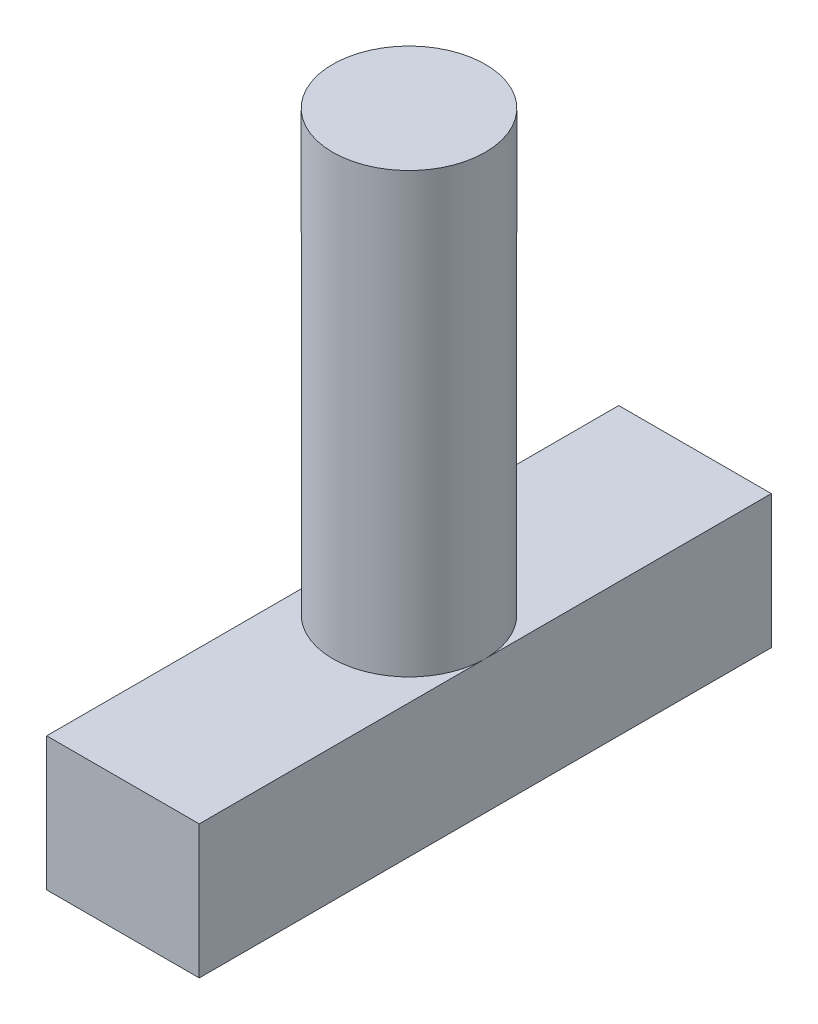
ISO-10303-21;
HEADER;
FILE_DESCRIPTION(('STEP AP214'),'2;1');
FILE_NAME('part.step','',(''),(''),'','','');
FILE_SCHEMA(('AUTOMOTIVE_DESIGN { 1 0 10303 214 1 1 1 1 }'));
ENDSEC;
DATA;
#1=APPLICATION_CONTEXT('core data for automotive mechanical design processes');
#2=APPLICATION_PROTOCOL_DEFINITION('international standard','automotive_design',2000,#1);
#3=PRODUCT_CONTEXT('',#1,'mechanical');
#4=PRODUCT('Part','Part','',(#3));
#5=PRODUCT_RELATED_PRODUCT_CATEGORY('part','',(#4));
#6=PRODUCT_DEFINITION_FORMATION('','',#4);
#7=PRODUCT_DEFINITION_CONTEXT('part definition',#1,'design');
#8=PRODUCT_DEFINITION('design','',#6,#7);
#9=PRODUCT_DEFINITION_SHAPE('','',#8);
#10=(LENGTH_UNIT() NAMED_UNIT(*) SI_UNIT(.MILLI.,.METRE.));
#11=(NAMED_UNIT(*) PLANE_ANGLE_UNIT() SI_UNIT($,.RADIAN.));
#12=(NAMED_UNIT(*) SI_UNIT($,.STERADIAN.) SOLID_ANGLE_UNIT());
#13=UNCERTAINTY_MEASURE_WITH_UNIT(LENGTH_MEASURE(1.E-05),#10,'distance_accuracy_value','');
#14=(GEOMETRIC_REPRESENTATION_CONTEXT(3) GLOBAL_UNCERTAINTY_ASSIGNED_CONTEXT((#13)) GLOBAL_UNIT_ASSIGNED_CONTEXT((#10,
#11,#12)) REPRESENTATION_CONTEXT('',''));
#15=CARTESIAN_POINT('',(0.,0.,0.));
#16=DIRECTION('',(0.,0.,1.));
#17=DIRECTION('',(1.,0.,0.));
#18=AXIS2_PLACEMENT_3D('',#15,#16,#17);
#19=CARTESIAN_POINT('',(0.,15.,0.));
#20=DIRECTION('',(0.,-1.,0.));
#21=DIRECTION('',(0.,0.,-1.));
#22=AXIS2_PLACEMENT_3D('',#19,#20,#21);
#23=CYLINDRICAL_SURFACE('',#22,2.);
#24=CARTESIAN_POINT('',(0.,15.,0.));
#25=DIRECTION('',(0.,1.,0.));
#26=DIRECTION('',(0.,0.,1.));
#27=AXIS2_PLACEMENT_3D('',#24,#25,#26);
#28=CIRCLE('',#27,2.);
#29=CARTESIAN_POINT('',(0.,15.,2.));
#30=VERTEX_POINT('',#29);
#31=EDGE_CURVE('E99',#30,#30,#28,.T.);
#32=ORIENTED_EDGE('',*,*,#31,.F.);
#33=EDGE_LOOP('',(#32));
#34=FACE_BOUND('',#33,.T.);
#35=CARTESIAN_POINT('',(0.,3.5,0.));
#36=DIRECTION('',(0.,-1.,0.));
#37=DIRECTION('',(0.,0.,-1.));
#38=AXIS2_PLACEMENT_3D('',#35,#36,#37);
#39=CIRCLE('',#38,2.);
#40=CARTESIAN_POINT('',(2.,3.5,0.));
#41=VERTEX_POINT('',#40);
#42=CARTESIAN_POINT('',(-2.,3.5,0.));
#43=VERTEX_POINT('',#42);
#44=EDGE_CURVE('E11',#41,#43,#39,.T.);
#45=ORIENTED_EDGE('',*,*,#44,.F.);
#46=EDGE_CURVE('E36',#43,#41,#39,.T.);
#47=ORIENTED_EDGE('',*,*,#46,.F.);
#48=EDGE_LOOP('',(#45,#47));
#49=FACE_BOUND('',#48,.T.);
#50=ADVANCED_FACE('F33',(#34,#49),#23,.T.);
#51=CARTESIAN_POINT('',(0.,15.,0.));
#52=DIRECTION('',(0.,1.,0.));
#53=DIRECTION('',(0.,0.,1.));
#54=AXIS2_PLACEMENT_3D('',#51,#52,#53);
#55=PLANE('',#54);
#56=ORIENTED_EDGE('',*,*,#31,.T.);
#57=EDGE_LOOP('',(#56));
#58=FACE_BOUND('',#57,.T.);
#59=ADVANCED_FACE('F142',(#58),#55,.T.);
#60=CARTESIAN_POINT('',(0.,3.5,0.));
#61=DIRECTION('',(0.,-1.,0.));
#62=DIRECTION('',(0.,0.,-1.));
#63=AXIS2_PLACEMENT_3D('',#60,#61,#62);
#64=PLANE('',#63);
#65=DIRECTION('',(0.,0.,-1.));
#66=VECTOR('',#65,1.);
#67=CARTESIAN_POINT('',(2.,3.5,-7.5));
#68=LINE('',#67,#66);
#69=CARTESIAN_POINT('',(2.,3.5,7.5));
#70=VERTEX_POINT('',#69);
#71=EDGE_CURVE('E118',#70,#41,#68,.T.);
#72=ORIENTED_EDGE('',*,*,#71,.T.);
#73=ORIENTED_EDGE('',*,*,#44,.T.);
#74=DIRECTION('',(0.,0.,1.));
#75=VECTOR('',#74,1.);
#76=CARTESIAN_POINT('',(-2.,3.5,-7.5));
#77=LINE('',#76,#75);
#78=CARTESIAN_POINT('',(-2.,3.5,7.5));
#79=VERTEX_POINT('',#78);
#80=EDGE_CURVE('E72',#43,#79,#77,.T.);
#81=ORIENTED_EDGE('',*,*,#80,.T.);
#82=DIRECTION('',(1.,0.,0.));
#83=VECTOR('',#82,1.);
#84=CARTESIAN_POINT('',(2.,3.5,7.5));
#85=LINE('',#84,#83);
#86=EDGE_CURVE('E76',#79,#70,#85,.T.);
#87=ORIENTED_EDGE('',*,*,#86,.T.);
#88=EDGE_LOOP('',(#72,#73,#81,#87));
#89=FACE_BOUND('',#88,.T.);
#90=ADVANCED_FACE('F75',(#89),#64,.F.);
#91=CARTESIAN_POINT('',(-2.,3.5,-7.5));
#92=VERTEX_POINT('',#91);
#93=EDGE_CURVE('E82',#92,#43,#77,.T.);
#94=ORIENTED_EDGE('',*,*,#93,.T.);
#95=ORIENTED_EDGE('',*,*,#46,.T.);
#96=CARTESIAN_POINT('',(2.,3.5,-7.5));
#97=VERTEX_POINT('',#96);
#98=EDGE_CURVE('E93',#41,#97,#68,.T.);
#99=ORIENTED_EDGE('',*,*,#98,.T.);
#100=DIRECTION('',(-1.,0.,0.));
#101=VECTOR('',#100,1.);
#102=CARTESIAN_POINT('',(2.,3.5,-7.5));
#103=LINE('',#102,#101);
#104=EDGE_CURVE('E109',#97,#92,#103,.T.);
#105=ORIENTED_EDGE('',*,*,#104,.T.);
#106=EDGE_LOOP('',(#94,#95,#99,#105));
#107=FACE_BOUND('',#106,.T.);
#108=ADVANCED_FACE('F120',(#107),#64,.F.);
#109=CARTESIAN_POINT('',(-2.,3.5,-7.5));
#110=DIRECTION('',(1.,0.,0.));
#111=DIRECTION('',(0.,0.,-1.));
#112=AXIS2_PLACEMENT_3D('',#109,#110,#111);
#113=PLANE('',#112);
#114=ORIENTED_EDGE('',*,*,#80,.F.);
#115=ORIENTED_EDGE('',*,*,#93,.F.);
#116=DIRECTION('',(0.,-1.,0.));
#117=VECTOR('',#116,1.);
#118=CARTESIAN_POINT('',(-2.,3.5,-7.5));
#119=LINE('',#118,#117);
#120=CARTESIAN_POINT('',(-2.,0.,-7.5));
#121=VERTEX_POINT('',#120);
#122=EDGE_CURVE('E107',#92,#121,#119,.T.);
#123=ORIENTED_EDGE('',*,*,#122,.T.);
#124=DIRECTION('',(0.,0.,1.));
#125=VECTOR('',#124,1.);
#126=CARTESIAN_POINT('',(-2.,0.,-7.5));
#127=LINE('',#126,#125);
#128=CARTESIAN_POINT('',(-2.,0.,7.5));
#129=VERTEX_POINT('',#128);
#130=EDGE_CURVE('E97',#121,#129,#127,.T.);
#131=ORIENTED_EDGE('',*,*,#130,.T.);
#132=DIRECTION('',(0.,-1.,0.));
#133=VECTOR('',#132,1.);
#134=CARTESIAN_POINT('',(-2.,3.5,7.5));
#135=LINE('',#134,#133);
#136=EDGE_CURVE('E89',#79,#129,#135,.T.);
#137=ORIENTED_EDGE('',*,*,#136,.F.);
#138=EDGE_LOOP('',(#114,#115,#123,#131,#137));
#139=FACE_BOUND('',#138,.T.);
#140=ADVANCED_FACE('F95',(#139),#113,.F.);
#141=CARTESIAN_POINT('',(2.,3.5,-7.5));
#142=DIRECTION('',(-1.,0.,0.));
#143=DIRECTION('',(0.,0.,1.));
#144=AXIS2_PLACEMENT_3D('',#141,#142,#143);
#145=PLANE('',#144);
#146=ORIENTED_EDGE('',*,*,#98,.F.);
#147=ORIENTED_EDGE('',*,*,#71,.F.);
#148=DIRECTION('',(0.,-1.,0.));
#149=VECTOR('',#148,1.);
#150=CARTESIAN_POINT('',(2.,3.5,7.5));
#151=LINE('',#150,#149);
#152=CARTESIAN_POINT('',(2.,0.,7.5));
#153=VERTEX_POINT('',#152);
#154=EDGE_CURVE('E91',#70,#153,#151,.T.);
#155=ORIENTED_EDGE('',*,*,#154,.T.);
#156=DIRECTION('',(0.,0.,-1.));
#157=VECTOR('',#156,1.);
#158=CARTESIAN_POINT('',(2.,0.,-7.5));
#159=LINE('',#158,#157);
#160=CARTESIAN_POINT('',(2.,0.,-7.5));
#161=VERTEX_POINT('',#160);
#162=EDGE_CURVE('E112',#153,#161,#159,.T.);
#163=ORIENTED_EDGE('',*,*,#162,.T.);
#164=DIRECTION('',(0.,-1.,0.));
#165=VECTOR('',#164,1.);
#166=CARTESIAN_POINT('',(2.,3.5,-7.5));
#167=LINE('',#166,#165);
#168=EDGE_CURVE('E102',#97,#161,#167,.T.);
#169=ORIENTED_EDGE('',*,*,#168,.F.);
#170=EDGE_LOOP('',(#146,#147,#155,#163,#169));
#171=FACE_BOUND('',#170,.T.);
#172=ADVANCED_FACE('F131',(#171),#145,.F.);
#173=CARTESIAN_POINT('',(2.,3.5,7.5));
#174=DIRECTION('',(0.,0.,-1.));
#175=DIRECTION('',(-1.,0.,0.));
#176=AXIS2_PLACEMENT_3D('',#173,#174,#175);
#177=PLANE('',#176);
#178=DIRECTION('',(1.,0.,0.));
#179=VECTOR('',#178,1.);
#180=CARTESIAN_POINT('',(2.,0.,7.5));
#181=LINE('',#180,#179);
#182=EDGE_CURVE('E114',#129,#153,#181,.T.);
#183=ORIENTED_EDGE('',*,*,#182,.T.);
#184=ORIENTED_EDGE('',*,*,#154,.F.);
#185=ORIENTED_EDGE('',*,*,#86,.F.);
#186=ORIENTED_EDGE('',*,*,#136,.T.);
#187=EDGE_LOOP('',(#183,#184,#185,#186));
#188=FACE_BOUND('',#187,.T.);
#189=ADVANCED_FACE('F88',(#188),#177,.F.);
#190=CARTESIAN_POINT('',(2.,3.5,-7.5));
#191=DIRECTION('',(0.,0.,1.));
#192=DIRECTION('',(1.,0.,0.));
#193=AXIS2_PLACEMENT_3D('',#190,#191,#192);
#194=PLANE('',#193);
#195=DIRECTION('',(-1.,0.,0.));
#196=VECTOR('',#195,1.);
#197=CARTESIAN_POINT('',(2.,0.,-7.5));
#198=LINE('',#197,#196);
#199=EDGE_CURVE('E83',#161,#121,#198,.T.);
#200=ORIENTED_EDGE('',*,*,#199,.T.);
#201=ORIENTED_EDGE('',*,*,#122,.F.);
#202=ORIENTED_EDGE('',*,*,#104,.F.);
#203=ORIENTED_EDGE('',*,*,#168,.T.);
#204=EDGE_LOOP('',(#200,#201,#202,#203));
#205=FACE_BOUND('',#204,.T.);
#206=ADVANCED_FACE('F125',(#205),#194,.F.);
#207=CARTESIAN_POINT('',(0.,0.,0.));
#208=DIRECTION('',(0.,1.,0.));
#209=DIRECTION('',(0.,0.,1.));
#210=AXIS2_PLACEMENT_3D('',#207,#208,#209);
#211=PLANE('',#210);
#212=ORIENTED_EDGE('',*,*,#162,.F.);
#213=ORIENTED_EDGE('',*,*,#182,.F.);
#214=ORIENTED_EDGE('',*,*,#130,.F.);
#215=ORIENTED_EDGE('',*,*,#199,.F.);
#216=EDGE_LOOP('',(#212,#213,#214,#215));
#217=FACE_BOUND('',#216,.T.);
#218=ADVANCED_FACE('F129',(#217),#211,.F.);
#219=CLOSED_SHELL('',(#50,#59,#90,#108,#140,#172,#189,#206,#218));
#220=MANIFOLD_SOLID_BREP('B2',#219);
#221=ADVANCED_BREP_SHAPE_REPRESENTATION('',(#18,#220),#14);
#222=SHAPE_DEFINITION_REPRESENTATION(#9,#221);
ENDSEC;
END-ISO-10303-21;
